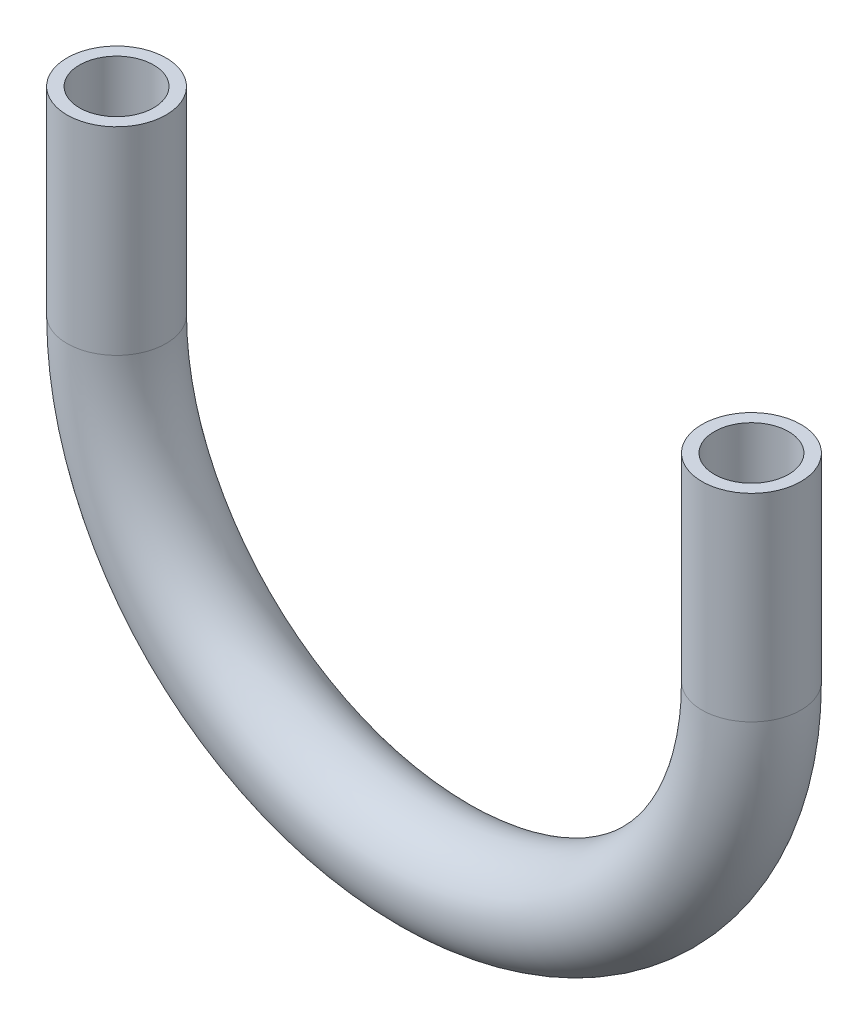
ISO-10303-21;
HEADER;
FILE_DESCRIPTION(('STEP AP214'),'2;1');
FILE_NAME('part.step','',(''),(''),'','','');
FILE_SCHEMA(('AUTOMOTIVE_DESIGN { 1 0 10303 214 1 1 1 1 }'));
ENDSEC;
DATA;
#1=APPLICATION_CONTEXT('core data for automotive mechanical design processes');
#2=APPLICATION_PROTOCOL_DEFINITION('international standard','automotive_design',2000,#1);
#3=PRODUCT_CONTEXT('',#1,'mechanical');
#4=PRODUCT('Part','Part','',(#3));
#5=PRODUCT_RELATED_PRODUCT_CATEGORY('part','',(#4));
#6=PRODUCT_DEFINITION_FORMATION('','',#4);
#7=PRODUCT_DEFINITION_CONTEXT('part definition',#1,'design');
#8=PRODUCT_DEFINITION('design','',#6,#7);
#9=PRODUCT_DEFINITION_SHAPE('','',#8);
#10=(LENGTH_UNIT() NAMED_UNIT(*) SI_UNIT(.MILLI.,.METRE.));
#11=(NAMED_UNIT(*) PLANE_ANGLE_UNIT() SI_UNIT($,.RADIAN.));
#12=(NAMED_UNIT(*) SI_UNIT($,.STERADIAN.) SOLID_ANGLE_UNIT());
#13=UNCERTAINTY_MEASURE_WITH_UNIT(LENGTH_MEASURE(1.E-05),#10,'distance_accuracy_value','');
#14=(GEOMETRIC_REPRESENTATION_CONTEXT(3) GLOBAL_UNCERTAINTY_ASSIGNED_CONTEXT((#13)) GLOBAL_UNIT_ASSIGNED_CONTEXT((#10,
#11,#12)) REPRESENTATION_CONTEXT('',''));
#15=CARTESIAN_POINT('',(0.,0.,0.));
#16=DIRECTION('',(0.,0.,1.));
#17=DIRECTION('',(1.,0.,0.));
#18=AXIS2_PLACEMENT_3D('',#15,#16,#17);
#19=CARTESIAN_POINT('',(162.921024424,0.,0.));
#20=DIRECTION('',(0.,-1.,0.));
#21=DIRECTION('',(0.,0.,1.));
#22=AXIS2_PLACEMENT_3D('',#19,#20,#21);
#23=PLANE('',#22);
#24=CARTESIAN_POINT('',(162.921024424,0.,0.));
#25=DIRECTION('',(0.,-1.,0.));
#26=DIRECTION('',(0.,0.,1.));
#27=AXIS2_PLACEMENT_3D('',#24,#25,#26);
#28=CIRCLE('',#27,9.525);
#29=CARTESIAN_POINT('',(162.921024424,0.,9.525));
#30=VERTEX_POINT('',#29);
#31=EDGE_CURVE('E64',#30,#30,#28,.T.);
#32=ORIENTED_EDGE('',*,*,#31,.T.);
#33=EDGE_LOOP('',(#32));
#34=FACE_BOUND('',#33,.T.);
#35=CARTESIAN_POINT('',(162.921024424,0.,0.));
#36=DIRECTION('',(0.,-1.,0.));
#37=DIRECTION('',(0.,0.,-1.));
#38=AXIS2_PLACEMENT_3D('',#35,#36,#37);
#39=CIRCLE('',#38,12.7);
#40=CARTESIAN_POINT('',(162.921024424,0.,-12.7));
#41=VERTEX_POINT('',#40);
#42=EDGE_CURVE('E47',#41,#41,#39,.T.);
#43=ORIENTED_EDGE('',*,*,#42,.F.);
#44=EDGE_LOOP('',(#43));
#45=FACE_BOUND('',#44,.T.);
#46=ADVANCED_FACE('F31',(#34,#45),#23,.F.);
#47=CARTESIAN_POINT('',(0.,0.,0.));
#48=DIRECTION('',(0.,1.,0.));
#49=DIRECTION('',(0.,0.,1.));
#50=AXIS2_PLACEMENT_3D('',#47,#48,#49);
#51=PLANE('',#50);
#52=CARTESIAN_POINT('',(0.,0.,0.));
#53=DIRECTION('',(0.,1.,0.));
#54=DIRECTION('',(0.,0.,1.));
#55=AXIS2_PLACEMENT_3D('',#52,#53,#54);
#56=CIRCLE('',#55,9.525);
#57=CARTESIAN_POINT('',(0.,0.,9.525));
#58=VERTEX_POINT('',#57);
#59=EDGE_CURVE('E51',#58,#58,#56,.T.);
#60=ORIENTED_EDGE('',*,*,#59,.F.);
#61=EDGE_LOOP('',(#60));
#62=FACE_BOUND('',#61,.T.);
#63=CARTESIAN_POINT('',(0.,0.,0.));
#64=DIRECTION('',(0.,1.,0.));
#65=DIRECTION('',(0.,0.,1.));
#66=AXIS2_PLACEMENT_3D('',#63,#64,#65);
#67=CIRCLE('',#66,12.7);
#68=CARTESIAN_POINT('',(0.,0.,12.7));
#69=VERTEX_POINT('',#68);
#70=EDGE_CURVE('E10',#69,#69,#67,.T.);
#71=ORIENTED_EDGE('',*,*,#70,.T.);
#72=EDGE_LOOP('',(#71));
#73=FACE_BOUND('',#72,.T.);
#74=ADVANCED_FACE('F87',(#62,#73),#51,.T.);
#75=CARTESIAN_POINT('',(162.921024424,0.,0.));
#76=DIRECTION('',(0.,-1.,0.));
#77=DIRECTION('',(0.,0.,-1.));
#78=AXIS2_PLACEMENT_3D('',#75,#76,#77);
#79=CYLINDRICAL_SURFACE('',#78,12.7);
#80=CARTESIAN_POINT('',(162.921024424,-50.8,0.));
#81=DIRECTION('',(0.,1.,0.));
#82=DIRECTION('',(-1.,0.,0.));
#83=AXIS2_PLACEMENT_3D('',#80,#81,#82);
#84=CIRCLE('',#83,12.7);
#85=CARTESIAN_POINT('',(175.621024424,-50.8,0.));
#86=VERTEX_POINT('',#85);
#87=EDGE_CURVE('E42',#86,#86,#84,.F.);
#88=ORIENTED_EDGE('',*,*,#87,.F.);
#89=EDGE_LOOP('',(#88));
#90=FACE_BOUND('',#89,.T.);
#91=ORIENTED_EDGE('',*,*,#42,.T.);
#92=EDGE_LOOP('',(#91));
#93=FACE_BOUND('',#92,.T.);
#94=ADVANCED_FACE('F90',(#90,#93),#79,.T.);
#95=CARTESIAN_POINT('',(81.460512212,-50.8,0.));
#96=DIRECTION('',(0.,0.,-1.));
#97=DIRECTION('',(-1.,0.,0.));
#98=AXIS2_PLACEMENT_3D('',#95,#96,#97);
#99=TOROIDAL_SURFACE('',#98,81.460512212,12.7);
#100=CARTESIAN_POINT('',(0.,-50.8,0.));
#101=DIRECTION('',(0.,1.,0.));
#102=DIRECTION('',(0.,0.,1.));
#103=AXIS2_PLACEMENT_3D('',#100,#101,#102);
#104=CIRCLE('',#103,12.7);
#105=CARTESIAN_POINT('',(-12.7,-50.8,0.));
#106=VERTEX_POINT('',#105);
#107=EDGE_CURVE('E38',#106,#106,#104,.T.);
#108=CARTESIAN_POINT('',(81.460512212,-50.8,0.));
#109=DIRECTION('',(0.,0.,-1.));
#110=DIRECTION('',(-1.,0.,0.));
#111=AXIS2_PLACEMENT_3D('',#108,#109,#110);
#112=CIRCLE('',#111,94.160512212);
#113=EDGE_CURVE('',#86,#106,#112,.T.);
#114=ORIENTED_EDGE('',*,*,#87,.T.);
#115=ORIENTED_EDGE('',*,*,#107,.F.);
#116=ORIENTED_EDGE('',*,*,#113,.T.);
#117=ORIENTED_EDGE('',*,*,#113,.F.);
#118=EDGE_LOOP('',(#114,#116,#115,#117));
#119=FACE_BOUND('',#118,.T.);
#120=ADVANCED_FACE('F82',(#119),#99,.T.);
#121=CARTESIAN_POINT('',(0.,-50.8,0.));
#122=DIRECTION('',(0.,1.,0.));
#123=DIRECTION('',(0.,0.,1.));
#124=AXIS2_PLACEMENT_3D('',#121,#122,#123);
#125=CYLINDRICAL_SURFACE('',#124,12.7);
#126=ORIENTED_EDGE('',*,*,#70,.F.);
#127=EDGE_LOOP('',(#126));
#128=FACE_BOUND('',#127,.T.);
#129=ORIENTED_EDGE('',*,*,#107,.T.);
#130=EDGE_LOOP('',(#129));
#131=FACE_BOUND('',#130,.T.);
#132=ADVANCED_FACE('F33',(#128,#131),#125,.T.);
#133=CARTESIAN_POINT('',(162.921024424,0.,0.));
#134=DIRECTION('',(0.,-1.,0.));
#135=DIRECTION('',(0.,0.,-1.));
#136=AXIS2_PLACEMENT_3D('',#133,#134,#135);
#137=CYLINDRICAL_SURFACE('',#136,9.525);
#138=CARTESIAN_POINT('',(162.921024424,-50.8,0.));
#139=DIRECTION('',(0.,-1.,0.));
#140=DIRECTION('',(0.,0.,1.));
#141=AXIS2_PLACEMENT_3D('',#138,#139,#140);
#142=CIRCLE('',#141,9.525);
#143=CARTESIAN_POINT('',(172.446024424,-50.8,0.));
#144=VERTEX_POINT('',#143);
#145=EDGE_CURVE('E59',#144,#144,#142,.T.);
#146=ORIENTED_EDGE('',*,*,#145,.T.);
#147=EDGE_LOOP('',(#146));
#148=FACE_BOUND('',#147,.T.);
#149=ORIENTED_EDGE('',*,*,#31,.F.);
#150=EDGE_LOOP('',(#149));
#151=FACE_BOUND('',#150,.T.);
#152=ADVANCED_FACE('F70',(#148,#151),#137,.F.);
#153=CARTESIAN_POINT('',(81.460512212,-50.8,0.));
#154=DIRECTION('',(0.,0.,-1.));
#155=DIRECTION('',(-1.,0.,0.));
#156=AXIS2_PLACEMENT_3D('',#153,#154,#155);
#157=TOROIDAL_SURFACE('',#156,81.460512212,9.525);
#158=CARTESIAN_POINT('',(0.,-50.8,0.));
#159=DIRECTION('',(0.,1.,0.));
#160=DIRECTION('',(0.,0.,1.));
#161=AXIS2_PLACEMENT_3D('',#158,#159,#160);
#162=CIRCLE('',#161,9.525);
#163=CARTESIAN_POINT('',(-9.52499999999999,-50.8,0.));
#164=VERTEX_POINT('',#163);
#165=EDGE_CURVE('E55',#164,#164,#162,.T.);
#166=CARTESIAN_POINT('',(81.460512212,-50.8,0.));
#167=DIRECTION('',(0.,0.,-1.));
#168=DIRECTION('',(-1.,0.,0.));
#169=AXIS2_PLACEMENT_3D('',#166,#167,#168);
#170=CIRCLE('',#169,90.985512212);
#171=EDGE_CURVE('',#144,#164,#170,.T.);
#172=ORIENTED_EDGE('',*,*,#145,.F.);
#173=ORIENTED_EDGE('',*,*,#165,.T.);
#174=ORIENTED_EDGE('',*,*,#171,.T.);
#175=ORIENTED_EDGE('',*,*,#171,.F.);
#176=EDGE_LOOP('',(#172,#174,#173,#175));
#177=FACE_BOUND('',#176,.T.);
#178=ADVANCED_FACE('F72',(#177),#157,.F.);
#179=CARTESIAN_POINT('',(0.,-50.8,0.));
#180=DIRECTION('',(0.,1.,0.));
#181=DIRECTION('',(0.,0.,1.));
#182=AXIS2_PLACEMENT_3D('',#179,#180,#181);
#183=CYLINDRICAL_SURFACE('',#182,9.525);
#184=ORIENTED_EDGE('',*,*,#59,.T.);
#185=EDGE_LOOP('',(#184));
#186=FACE_BOUND('',#185,.T.);
#187=ORIENTED_EDGE('',*,*,#165,.F.);
#188=EDGE_LOOP('',(#187));
#189=FACE_BOUND('',#188,.T.);
#190=ADVANCED_FACE('F79',(#186,#189),#183,.F.);
#191=CLOSED_SHELL('',(#46,#74,#94,#120,#132,#152,#178,#190));
#192=MANIFOLD_SOLID_BREP('B2',#191);
#193=ADVANCED_BREP_SHAPE_REPRESENTATION('',(#18,#192),#14);
#194=SHAPE_DEFINITION_REPRESENTATION(#9,#193);
ENDSEC;
END-ISO-10303-21;
